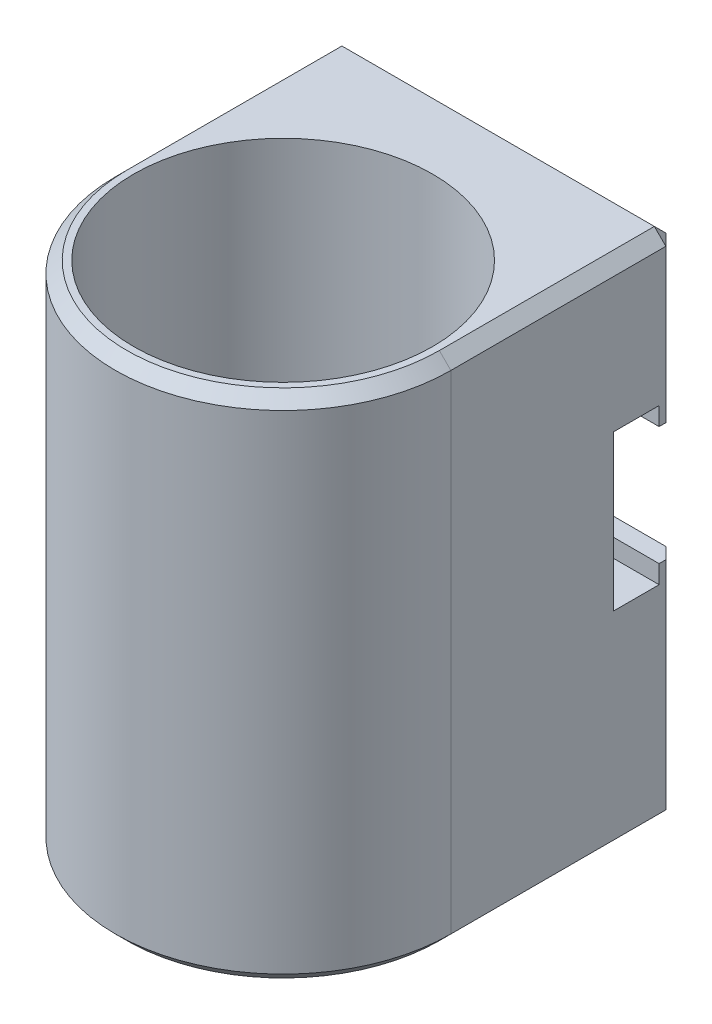
ISO-10303-21;
HEADER;
FILE_DESCRIPTION(('STEP AP214'),'2;1');
FILE_NAME('part.step','',(''),(''),'','','');
FILE_SCHEMA(('AUTOMOTIVE_DESIGN { 1 0 10303 214 1 1 1 1 }'));
ENDSEC;
DATA;
#1=APPLICATION_CONTEXT('core data for automotive mechanical design processes');
#2=APPLICATION_PROTOCOL_DEFINITION('international standard','automotive_design',2000,#1);
#3=PRODUCT_CONTEXT('',#1,'mechanical');
#4=PRODUCT('Part','Part','',(#3));
#5=PRODUCT_RELATED_PRODUCT_CATEGORY('part','',(#4));
#6=PRODUCT_DEFINITION_FORMATION('','',#4);
#7=PRODUCT_DEFINITION_CONTEXT('part definition',#1,'design');
#8=PRODUCT_DEFINITION('design','',#6,#7);
#9=PRODUCT_DEFINITION_SHAPE('','',#8);
#10=(LENGTH_UNIT() NAMED_UNIT(*) SI_UNIT(.MILLI.,.METRE.));
#11=(NAMED_UNIT(*) PLANE_ANGLE_UNIT() SI_UNIT($,.RADIAN.));
#12=(NAMED_UNIT(*) SI_UNIT($,.STERADIAN.) SOLID_ANGLE_UNIT());
#13=UNCERTAINTY_MEASURE_WITH_UNIT(LENGTH_MEASURE(1.E-05),#10,'distance_accuracy_value','');
#14=(GEOMETRIC_REPRESENTATION_CONTEXT(3) GLOBAL_UNCERTAINTY_ASSIGNED_CONTEXT((#13)) GLOBAL_UNIT_ASSIGNED_CONTEXT((#10,
#11,#12)) REPRESENTATION_CONTEXT('',''));
#15=CARTESIAN_POINT('',(0.,0.,0.));
#16=DIRECTION('',(0.,0.,1.));
#17=DIRECTION('',(1.,0.,0.));
#18=AXIS2_PLACEMENT_3D('',#15,#16,#17);
#19=CARTESIAN_POINT('',(-14.5875,44.45,-19.7));
#20=DIRECTION('',(0.,0.,1.));
#21=DIRECTION('',(1.,0.,0.));
#22=AXIS2_PLACEMENT_3D('',#19,#20,#21);
#23=PLANE('',#22);
#24=DIRECTION('',(-1.,0.,0.));
#25=VECTOR('',#24,1.);
#26=CARTESIAN_POINT('',(-14.5875,1.,-19.7));
#27=LINE('',#26,#25);
#28=CARTESIAN_POINT('',(13.5875,1.,-19.7));
#29=VERTEX_POINT('',#28);
#30=CARTESIAN_POINT('',(-13.5875,1.,-19.7));
#31=VERTEX_POINT('',#30);
#32=EDGE_CURVE('E265',#29,#31,#27,.T.);
#33=ORIENTED_EDGE('',*,*,#32,.T.);
#34=DIRECTION('',(0.,1.,0.));
#35=VECTOR('',#34,1.);
#36=CARTESIAN_POINT('',(-13.5875,44.45,-19.7));
#37=LINE('',#36,#35);
#38=CARTESIAN_POINT('',(-13.5875,19.84375,-19.7));
#39=VERTEX_POINT('',#38);
#40=EDGE_CURVE('E269',#31,#39,#37,.T.);
#41=ORIENTED_EDGE('',*,*,#40,.T.);
#42=DIRECTION('',(1.,0.,0.));
#43=VECTOR('',#42,1.);
#44=CARTESIAN_POINT('',(-14.5875,19.84375,-19.7));
#45=LINE('',#44,#43);
#46=CARTESIAN_POINT('',(13.5875,19.84375,-19.7));
#47=VERTEX_POINT('',#46);
#48=EDGE_CURVE('E231',#39,#47,#45,.T.);
#49=ORIENTED_EDGE('',*,*,#48,.T.);
#50=DIRECTION('',(0.,-1.,0.));
#51=VECTOR('',#50,1.);
#52=CARTESIAN_POINT('',(13.5875,44.45,-19.7));
#53=LINE('',#52,#51);
#54=EDGE_CURVE('E267',#47,#29,#53,.T.);
#55=ORIENTED_EDGE('',*,*,#54,.T.);
#56=EDGE_LOOP('',(#33,#41,#49,#55));
#57=FACE_BOUND('',#56,.T.);
#58=ADVANCED_FACE('F33',(#57),#23,.F.);
#59=CARTESIAN_POINT('',(0.,44.45,0.));
#60=DIRECTION('',(0.,1.,0.));
#61=DIRECTION('',(0.,0.,1.));
#62=AXIS2_PLACEMENT_3D('',#59,#60,#61);
#63=PLANE('',#62);
#64=DIRECTION('',(0.,0.,-1.));
#65=VECTOR('',#64,1.);
#66=CARTESIAN_POINT('',(13.5875,44.45,-19.7));
#67=LINE('',#66,#65);
#68=CARTESIAN_POINT('',(13.5875,44.45,0.));
#69=VERTEX_POINT('',#68);
#70=CARTESIAN_POINT('',(13.5875,44.45,-18.7));
#71=VERTEX_POINT('',#70);
#72=EDGE_CURVE('E57',#69,#71,#67,.T.);
#73=ORIENTED_EDGE('',*,*,#72,.T.);
#74=DIRECTION('',(-1.,0.,0.));
#75=VECTOR('',#74,1.);
#76=CARTESIAN_POINT('',(-14.5875,44.45,-18.7));
#77=LINE('',#76,#75);
#78=CARTESIAN_POINT('',(-13.5875,44.45,-18.7));
#79=VERTEX_POINT('',#78);
#80=EDGE_CURVE('E11',#71,#79,#77,.T.);
#81=ORIENTED_EDGE('',*,*,#80,.T.);
#82=DIRECTION('',(0.,0.,1.));
#83=VECTOR('',#82,1.);
#84=CARTESIAN_POINT('',(-13.5875,44.45,0.));
#85=LINE('',#84,#83);
#86=CARTESIAN_POINT('',(-13.5875,44.45,0.));
#87=VERTEX_POINT('',#86);
#88=EDGE_CURVE('E42',#79,#87,#85,.T.);
#89=ORIENTED_EDGE('',*,*,#88,.T.);
#90=CARTESIAN_POINT('',(0.,44.45,0.));
#91=DIRECTION('',(0.,1.,0.));
#92=DIRECTION('',(0.,0.,1.));
#93=AXIS2_PLACEMENT_3D('',#90,#91,#92);
#94=CIRCLE('',#93,13.5875);
#95=EDGE_CURVE('E307',#87,#69,#94,.T.);
#96=ORIENTED_EDGE('',*,*,#95,.T.);
#97=EDGE_LOOP('',(#73,#81,#89,#96));
#98=FACE_BOUND('',#97,.T.);
#99=CARTESIAN_POINT('',(0.,44.45,0.));
#100=DIRECTION('',(0.,1.,0.));
#101=DIRECTION('',(0.,0.,1.));
#102=AXIS2_PLACEMENT_3D('',#99,#100,#101);
#103=CIRCLE('',#102,13.);
#104=CARTESIAN_POINT('',(0.,44.45,13.));
#105=VERTEX_POINT('',#104);
#106=EDGE_CURVE('E245',#105,#105,#103,.T.);
#107=ORIENTED_EDGE('',*,*,#106,.F.);
#108=EDGE_LOOP('',(#107));
#109=FACE_BOUND('',#108,.T.);
#110=ADVANCED_FACE('F442',(#98,#109),#63,.T.);
#111=CARTESIAN_POINT('',(0.,0.,0.));
#112=DIRECTION('',(0.,1.,0.));
#113=DIRECTION('',(0.,0.,1.));
#114=AXIS2_PLACEMENT_3D('',#111,#112,#113);
#115=PLANE('',#114);
#116=DIRECTION('',(0.,0.,-1.));
#117=VECTOR('',#116,1.);
#118=CARTESIAN_POINT('',(-13.5875,0.,0.));
#119=LINE('',#118,#117);
#120=CARTESIAN_POINT('',(-13.5875,0.,0.));
#121=VERTEX_POINT('',#120);
#122=CARTESIAN_POINT('',(-13.5875,0.,-18.7));
#123=VERTEX_POINT('',#122);
#124=EDGE_CURVE('E287',#121,#123,#119,.T.);
#125=ORIENTED_EDGE('',*,*,#124,.T.);
#126=DIRECTION('',(1.,0.,0.));
#127=VECTOR('',#126,1.);
#128=CARTESIAN_POINT('',(0.,0.,-18.7));
#129=LINE('',#128,#127);
#130=CARTESIAN_POINT('',(13.5875,0.,-18.7));
#131=VERTEX_POINT('',#130);
#132=EDGE_CURVE('E289',#123,#131,#129,.T.);
#133=ORIENTED_EDGE('',*,*,#132,.T.);
#134=DIRECTION('',(0.,0.,1.));
#135=VECTOR('',#134,1.);
#136=CARTESIAN_POINT('',(13.5875,0.,0.));
#137=LINE('',#136,#135);
#138=CARTESIAN_POINT('',(13.5875,0.,0.));
#139=VERTEX_POINT('',#138);
#140=EDGE_CURVE('E283',#131,#139,#137,.T.);
#141=ORIENTED_EDGE('',*,*,#140,.T.);
#142=CARTESIAN_POINT('',(0.,0.,0.));
#143=DIRECTION('',(0.,1.,0.));
#144=DIRECTION('',(0.,0.,1.));
#145=AXIS2_PLACEMENT_3D('',#142,#143,#144);
#146=CIRCLE('',#145,13.5875);
#147=EDGE_CURVE('E285',#139,#121,#146,.F.);
#148=ORIENTED_EDGE('',*,*,#147,.T.);
#149=EDGE_LOOP('',(#125,#133,#141,#148));
#150=FACE_BOUND('',#149,.T.);
#151=CARTESIAN_POINT('',(0.,0.,0.));
#152=DIRECTION('',(0.,1.,0.));
#153=DIRECTION('',(0.,0.,1.));
#154=AXIS2_PLACEMENT_3D('',#151,#152,#153);
#155=CIRCLE('',#154,13.);
#156=CARTESIAN_POINT('',(0.,0.,13.));
#157=VERTEX_POINT('',#156);
#158=EDGE_CURVE('E234',#157,#157,#155,.T.);
#159=ORIENTED_EDGE('',*,*,#158,.T.);
#160=EDGE_LOOP('',(#159));
#161=FACE_BOUND('',#160,.T.);
#162=ADVANCED_FACE('F439',(#150,#161),#115,.F.);
#163=CARTESIAN_POINT('',(0.,44.45,0.));
#164=DIRECTION('',(0.,-1.,0.));
#165=DIRECTION('',(0.,0.,-1.));
#166=AXIS2_PLACEMENT_3D('',#163,#164,#165);
#167=CYLINDRICAL_SURFACE('',#166,14.5875);
#168=DIRECTION('',(0.,-1.,0.));
#169=VECTOR('',#168,1.);
#170=CARTESIAN_POINT('',(-14.5875,44.45,0.));
#171=LINE('',#170,#169);
#172=CARTESIAN_POINT('',(-14.5875,43.45,0.));
#173=VERTEX_POINT('',#172);
#174=CARTESIAN_POINT('',(-14.5875,1.,0.));
#175=VERTEX_POINT('',#174);
#176=EDGE_CURVE('E248',#173,#175,#171,.T.);
#177=ORIENTED_EDGE('',*,*,#176,.T.);
#178=CARTESIAN_POINT('',(0.,1.,0.));
#179=DIRECTION('',(0.,1.,0.));
#180=DIRECTION('',(0.,0.,1.));
#181=AXIS2_PLACEMENT_3D('',#178,#179,#180);
#182=CIRCLE('',#181,14.5875);
#183=CARTESIAN_POINT('',(14.5875,1.,0.));
#184=VERTEX_POINT('',#183);
#185=EDGE_CURVE('E294',#175,#184,#182,.T.);
#186=ORIENTED_EDGE('',*,*,#185,.T.);
#187=DIRECTION('',(0.,-1.,0.));
#188=VECTOR('',#187,1.);
#189=CARTESIAN_POINT('',(14.5875,44.45,0.));
#190=LINE('',#189,#188);
#191=CARTESIAN_POINT('',(14.5875,43.45,0.));
#192=VERTEX_POINT('',#191);
#193=EDGE_CURVE('E253',#192,#184,#190,.T.);
#194=ORIENTED_EDGE('',*,*,#193,.F.);
#195=CARTESIAN_POINT('',(0.,43.45,0.));
#196=DIRECTION('',(0.,1.,0.));
#197=DIRECTION('',(0.,0.,1.));
#198=AXIS2_PLACEMENT_3D('',#195,#196,#197);
#199=CIRCLE('',#198,14.5875);
#200=EDGE_CURVE('E292',#192,#173,#199,.F.);
#201=ORIENTED_EDGE('',*,*,#200,.T.);
#202=EDGE_LOOP('',(#177,#186,#194,#201));
#203=FACE_BOUND('',#202,.T.);
#204=ADVANCED_FACE('F415',(#203),#167,.T.);
#205=CARTESIAN_POINT('',(14.5875,44.45,-19.7));
#206=DIRECTION('',(-1.,0.,0.));
#207=DIRECTION('',(0.,0.,1.));
#208=AXIS2_PLACEMENT_3D('',#205,#206,#207);
#209=PLANE('',#208);
#210=DIRECTION('',(0.,0.,-1.));
#211=VECTOR('',#210,1.);
#212=CARTESIAN_POINT('',(14.5875,1.,-19.7));
#213=LINE('',#212,#211);
#214=CARTESIAN_POINT('',(14.5875,1.,-18.7));
#215=VERTEX_POINT('',#214);
#216=EDGE_CURVE('E279',#184,#215,#213,.T.);
#217=ORIENTED_EDGE('',*,*,#216,.T.);
#218=DIRECTION('',(0.,1.,0.));
#219=VECTOR('',#218,1.);
#220=CARTESIAN_POINT('',(14.5875,44.45,-18.7));
#221=LINE('',#220,#219);
#222=CARTESIAN_POINT('',(14.5875,19.84375,-18.7));
#223=VERTEX_POINT('',#222);
#224=EDGE_CURVE('E281',#215,#223,#221,.T.);
#225=ORIENTED_EDGE('',*,*,#224,.T.);
#226=DIRECTION('',(0.,0.,-1.));
#227=VECTOR('',#226,1.);
#228=CARTESIAN_POINT('',(14.5875,19.84375,-18.1125));
#229=LINE('',#228,#227);
#230=CARTESIAN_POINT('',(14.5875,19.84375,-18.1125));
#231=VERTEX_POINT('',#230);
#232=EDGE_CURVE('E201',#231,#223,#229,.T.);
#233=ORIENTED_EDGE('',*,*,#232,.F.);
#234=DIRECTION('',(0.,1.,0.));
#235=VECTOR('',#234,1.);
#236=CARTESIAN_POINT('',(14.5875,18.25625,-18.1125));
#237=LINE('',#236,#235);
#238=CARTESIAN_POINT('',(14.5875,18.25625,-18.1125));
#239=VERTEX_POINT('',#238);
#240=EDGE_CURVE('E226',#239,#231,#237,.T.);
#241=ORIENTED_EDGE('',*,*,#240,.F.);
#242=DIRECTION('',(0.,0.,-1.));
#243=VECTOR('',#242,1.);
#244=CARTESIAN_POINT('',(14.5875,18.25625,-14.14375));
#245=LINE('',#244,#243);
#246=CARTESIAN_POINT('',(14.5875,18.25625,-14.14375));
#247=VERTEX_POINT('',#246);
#248=EDGE_CURVE('E223',#247,#239,#245,.T.);
#249=ORIENTED_EDGE('',*,*,#248,.F.);
#250=DIRECTION('',(0.,-1.,0.));
#251=VECTOR('',#250,1.);
#252=CARTESIAN_POINT('',(14.5875,31.75,-14.14375));
#253=LINE('',#252,#251);
#254=CARTESIAN_POINT('',(14.5875,31.75,-14.14375));
#255=VERTEX_POINT('',#254);
#256=EDGE_CURVE('E220',#255,#247,#253,.T.);
#257=ORIENTED_EDGE('',*,*,#256,.F.);
#258=DIRECTION('',(0.,0.,1.));
#259=VECTOR('',#258,1.);
#260=CARTESIAN_POINT('',(14.5875,31.75,-18.1125));
#261=LINE('',#260,#259);
#262=CARTESIAN_POINT('',(14.5875,31.75,-18.1125));
#263=VERTEX_POINT('',#262);
#264=EDGE_CURVE('E218',#263,#255,#261,.T.);
#265=ORIENTED_EDGE('',*,*,#264,.F.);
#266=DIRECTION('',(0.,1.,0.));
#267=VECTOR('',#266,1.);
#268=CARTESIAN_POINT('',(14.5875,30.1625,-18.1125));
#269=LINE('',#268,#267);
#270=CARTESIAN_POINT('',(14.5875,30.1625,-18.1125));
#271=VERTEX_POINT('',#270);
#272=EDGE_CURVE('E181',#271,#263,#269,.T.);
#273=ORIENTED_EDGE('',*,*,#272,.F.);
#274=DIRECTION('',(0.,0.,1.));
#275=VECTOR('',#274,1.);
#276=CARTESIAN_POINT('',(14.5875,30.1625,-19.7));
#277=LINE('',#276,#275);
#278=CARTESIAN_POINT('',(14.5875,30.1625,-18.7));
#279=VERTEX_POINT('',#278);
#280=EDGE_CURVE('E214',#279,#271,#277,.T.);
#281=ORIENTED_EDGE('',*,*,#280,.F.);
#282=DIRECTION('',(0.,1.,0.));
#283=VECTOR('',#282,1.);
#284=CARTESIAN_POINT('',(14.5875,44.45,-18.7));
#285=LINE('',#284,#283);
#286=CARTESIAN_POINT('',(14.5875,43.45,-18.7));
#287=VERTEX_POINT('',#286);
#288=EDGE_CURVE('E277',#279,#287,#285,.T.);
#289=ORIENTED_EDGE('',*,*,#288,.T.);
#290=DIRECTION('',(0.,0.,1.));
#291=VECTOR('',#290,1.);
#292=CARTESIAN_POINT('',(14.5875,43.45,0.));
#293=LINE('',#292,#291);
#294=EDGE_CURVE('E275',#287,#192,#293,.T.);
#295=ORIENTED_EDGE('',*,*,#294,.T.);
#296=ORIENTED_EDGE('',*,*,#193,.T.);
#297=EDGE_LOOP('',(#217,#225,#233,#241,#249,#257,#265,#273,#281,#289,#295,#296));
#298=FACE_BOUND('',#297,.T.);
#299=ADVANCED_FACE('F380',(#298),#209,.F.);
#300=DIRECTION('',(1.,0.,0.));
#301=VECTOR('',#300,1.);
#302=CARTESIAN_POINT('',(14.5875,43.45,-19.7));
#303=LINE('',#302,#301);
#304=CARTESIAN_POINT('',(-13.5875,43.45,-19.7));
#305=VERTEX_POINT('',#304);
#306=CARTESIAN_POINT('',(13.5875,43.45,-19.7));
#307=VERTEX_POINT('',#306);
#308=EDGE_CURVE('E296',#305,#307,#303,.T.);
#309=ORIENTED_EDGE('',*,*,#308,.T.);
#310=DIRECTION('',(0.,-1.,0.));
#311=VECTOR('',#310,1.);
#312=CARTESIAN_POINT('',(13.5875,44.45,-19.7));
#313=LINE('',#312,#311);
#314=CARTESIAN_POINT('',(13.5875,30.1625,-19.7));
#315=VERTEX_POINT('',#314);
#316=EDGE_CURVE('E300',#307,#315,#313,.T.);
#317=ORIENTED_EDGE('',*,*,#316,.T.);
#318=DIRECTION('',(1.,0.,0.));
#319=VECTOR('',#318,1.);
#320=CARTESIAN_POINT('',(-14.5875,30.1625,-19.7));
#321=LINE('',#320,#319);
#322=CARTESIAN_POINT('',(-13.5875,30.1625,-19.7));
#323=VERTEX_POINT('',#322);
#324=EDGE_CURVE('E213',#323,#315,#321,.T.);
#325=ORIENTED_EDGE('',*,*,#324,.F.);
#326=DIRECTION('',(0.,1.,0.));
#327=VECTOR('',#326,1.);
#328=CARTESIAN_POINT('',(-13.5875,44.45,-19.7));
#329=LINE('',#328,#327);
#330=EDGE_CURVE('E298',#323,#305,#329,.T.);
#331=ORIENTED_EDGE('',*,*,#330,.T.);
#332=EDGE_LOOP('',(#309,#317,#325,#331));
#333=FACE_BOUND('',#332,.T.);
#334=ADVANCED_FACE('F371',(#333),#23,.F.);
#335=CARTESIAN_POINT('',(-14.5875,44.45,0.));
#336=DIRECTION('',(1.,0.,0.));
#337=DIRECTION('',(0.,0.,-1.));
#338=AXIS2_PLACEMENT_3D('',#335,#336,#337);
#339=PLANE('',#338);
#340=DIRECTION('',(0.,0.,-1.));
#341=VECTOR('',#340,1.);
#342=CARTESIAN_POINT('',(-14.5875,19.84375,-18.1125));
#343=LINE('',#342,#341);
#344=CARTESIAN_POINT('',(-14.5875,19.84375,-18.1125));
#345=VERTEX_POINT('',#344);
#346=CARTESIAN_POINT('',(-14.5875,19.84375,-18.7));
#347=VERTEX_POINT('',#346);
#348=EDGE_CURVE('E211',#345,#347,#343,.T.);
#349=ORIENTED_EDGE('',*,*,#348,.T.);
#350=DIRECTION('',(0.,-1.,0.));
#351=VECTOR('',#350,1.);
#352=CARTESIAN_POINT('',(-14.5875,44.45,-18.7));
#353=LINE('',#352,#351);
#354=CARTESIAN_POINT('',(-14.5875,1.,-18.7));
#355=VERTEX_POINT('',#354);
#356=EDGE_CURVE('E262',#347,#355,#353,.T.);
#357=ORIENTED_EDGE('',*,*,#356,.T.);
#358=DIRECTION('',(0.,0.,1.));
#359=VECTOR('',#358,1.);
#360=CARTESIAN_POINT('',(-14.5875,1.,0.));
#361=LINE('',#360,#359);
#362=EDGE_CURVE('E260',#355,#175,#361,.T.);
#363=ORIENTED_EDGE('',*,*,#362,.T.);
#364=ORIENTED_EDGE('',*,*,#176,.F.);
#365=DIRECTION('',(0.,0.,-1.));
#366=VECTOR('',#365,1.);
#367=CARTESIAN_POINT('',(-14.5875,43.45,-19.7));
#368=LINE('',#367,#366);
#369=CARTESIAN_POINT('',(-14.5875,43.45,-18.7));
#370=VERTEX_POINT('',#369);
#371=EDGE_CURVE('E256',#173,#370,#368,.T.);
#372=ORIENTED_EDGE('',*,*,#371,.T.);
#373=DIRECTION('',(0.,-1.,0.));
#374=VECTOR('',#373,1.);
#375=CARTESIAN_POINT('',(-14.5875,44.45,-18.7));
#376=LINE('',#375,#374);
#377=CARTESIAN_POINT('',(-14.5875,30.1625,-18.7));
#378=VERTEX_POINT('',#377);
#379=EDGE_CURVE('E258',#370,#378,#376,.T.);
#380=ORIENTED_EDGE('',*,*,#379,.T.);
#381=DIRECTION('',(0.,0.,1.));
#382=VECTOR('',#381,1.);
#383=CARTESIAN_POINT('',(-14.5875,30.1625,-19.7));
#384=LINE('',#383,#382);
#385=CARTESIAN_POINT('',(-14.5875,30.1625,-18.1125));
#386=VERTEX_POINT('',#385);
#387=EDGE_CURVE('E199',#378,#386,#384,.T.);
#388=ORIENTED_EDGE('',*,*,#387,.T.);
#389=DIRECTION('',(0.,1.,0.));
#390=VECTOR('',#389,1.);
#391=CARTESIAN_POINT('',(-14.5875,30.1625,-18.1125));
#392=LINE('',#391,#390);
#393=CARTESIAN_POINT('',(-14.5875,31.75,-18.1125));
#394=VERTEX_POINT('',#393);
#395=EDGE_CURVE('E178',#386,#394,#392,.T.);
#396=ORIENTED_EDGE('',*,*,#395,.T.);
#397=DIRECTION('',(0.,0.,1.));
#398=VECTOR('',#397,1.);
#399=CARTESIAN_POINT('',(-14.5875,31.75,-18.1125));
#400=LINE('',#399,#398);
#401=CARTESIAN_POINT('',(-14.5875,31.75,-14.14375));
#402=VERTEX_POINT('',#401);
#403=EDGE_CURVE('E189',#394,#402,#400,.T.);
#404=ORIENTED_EDGE('',*,*,#403,.T.);
#405=DIRECTION('',(0.,-1.,0.));
#406=VECTOR('',#405,1.);
#407=CARTESIAN_POINT('',(-14.5875,31.75,-14.14375));
#408=LINE('',#407,#406);
#409=CARTESIAN_POINT('',(-14.5875,18.25625,-14.14375));
#410=VERTEX_POINT('',#409);
#411=EDGE_CURVE('E194',#402,#410,#408,.T.);
#412=ORIENTED_EDGE('',*,*,#411,.T.);
#413=DIRECTION('',(0.,0.,-1.));
#414=VECTOR('',#413,1.);
#415=CARTESIAN_POINT('',(-14.5875,18.25625,-14.14375));
#416=LINE('',#415,#414);
#417=CARTESIAN_POINT('',(-14.5875,18.25625,-18.1125));
#418=VERTEX_POINT('',#417);
#419=EDGE_CURVE('E205',#410,#418,#416,.T.);
#420=ORIENTED_EDGE('',*,*,#419,.T.);
#421=DIRECTION('',(0.,1.,0.));
#422=VECTOR('',#421,1.);
#423=CARTESIAN_POINT('',(-14.5875,18.25625,-18.1125));
#424=LINE('',#423,#422);
#425=EDGE_CURVE('E208',#418,#345,#424,.T.);
#426=ORIENTED_EDGE('',*,*,#425,.T.);
#427=EDGE_LOOP('',(#349,#357,#363,#364,#372,#380,#388,#396,#404,#412,#420,#426));
#428=FACE_BOUND('',#427,.T.);
#429=ADVANCED_FACE('F197',(#428),#339,.F.);
#430=CARTESIAN_POINT('',(0.,44.45,0.));
#431=DIRECTION('',(0.,-1.,0.));
#432=DIRECTION('',(0.,0.,-1.));
#433=AXIS2_PLACEMENT_3D('',#430,#431,#432);
#434=CYLINDRICAL_SURFACE('',#433,13.);
#435=ORIENTED_EDGE('',*,*,#106,.T.);
#436=EDGE_LOOP('',(#435));
#437=FACE_BOUND('',#436,.T.);
#438=ORIENTED_EDGE('',*,*,#158,.F.);
#439=EDGE_LOOP('',(#438));
#440=FACE_BOUND('',#439,.T.);
#441=ADVANCED_FACE('F446',(#437,#440),#434,.F.);
#442=CARTESIAN_POINT('',(-14.5875,19.84375,-18.1125));
#443=DIRECTION('',(0.,-1.,0.));
#444=DIRECTION('',(0.,0.,-1.));
#445=AXIS2_PLACEMENT_3D('',#442,#443,#444);
#446=PLANE('',#445);
#447=ORIENTED_EDGE('',*,*,#48,.F.);
#448=DIRECTION('',(0.70710678118655,0.,-0.707106781186545));
#449=VECTOR('',#448,1.);
#450=CARTESIAN_POINT('',(-14.5875,19.84375,-18.7));
#451=LINE('',#450,#449);
#452=EDGE_CURVE('E273',#39,#347,#451,.F.);
#453=ORIENTED_EDGE('',*,*,#452,.T.);
#454=ORIENTED_EDGE('',*,*,#348,.F.);
#455=DIRECTION('',(1.,0.,0.));
#456=VECTOR('',#455,1.);
#457=CARTESIAN_POINT('',(-14.5875,19.84375,-18.1125));
#458=LINE('',#457,#456);
#459=EDGE_CURVE('E235',#345,#231,#458,.T.);
#460=ORIENTED_EDGE('',*,*,#459,.T.);
#461=ORIENTED_EDGE('',*,*,#232,.T.);
#462=DIRECTION('',(0.70710678118655,0.,0.707106781186545));
#463=VECTOR('',#462,1.);
#464=CARTESIAN_POINT('',(13.5875,19.84375,-19.7));
#465=LINE('',#464,#463);
#466=EDGE_CURVE('E271',#223,#47,#465,.F.);
#467=ORIENTED_EDGE('',*,*,#466,.T.);
#468=EDGE_LOOP('',(#447,#453,#454,#460,#461,#467));
#469=FACE_BOUND('',#468,.T.);
#470=ADVANCED_FACE('F397',(#469),#446,.F.);
#471=CARTESIAN_POINT('',(-14.5875,18.25625,-18.1125));
#472=DIRECTION('',(0.,0.,-1.));
#473=DIRECTION('',(-1.,0.,0.));
#474=AXIS2_PLACEMENT_3D('',#471,#472,#473);
#475=PLANE('',#474);
#476=ORIENTED_EDGE('',*,*,#240,.T.);
#477=ORIENTED_EDGE('',*,*,#459,.F.);
#478=ORIENTED_EDGE('',*,*,#425,.F.);
#479=DIRECTION('',(1.,0.,0.));
#480=VECTOR('',#479,1.);
#481=CARTESIAN_POINT('',(-14.5875,18.25625,-18.1125));
#482=LINE('',#481,#480);
#483=EDGE_CURVE('E237',#418,#239,#482,.T.);
#484=ORIENTED_EDGE('',*,*,#483,.T.);
#485=EDGE_LOOP('',(#476,#477,#478,#484));
#486=FACE_BOUND('',#485,.T.);
#487=ADVANCED_FACE('F392',(#486),#475,.F.);
#488=CARTESIAN_POINT('',(-14.5875,18.25625,-14.14375));
#489=DIRECTION('',(0.,-1.,0.));
#490=DIRECTION('',(0.,0.,-1.));
#491=AXIS2_PLACEMENT_3D('',#488,#489,#490);
#492=PLANE('',#491);
#493=ORIENTED_EDGE('',*,*,#248,.T.);
#494=ORIENTED_EDGE('',*,*,#483,.F.);
#495=ORIENTED_EDGE('',*,*,#419,.F.);
#496=DIRECTION('',(1.,0.,0.));
#497=VECTOR('',#496,1.);
#498=CARTESIAN_POINT('',(-14.5875,18.25625,-14.14375));
#499=LINE('',#498,#497);
#500=EDGE_CURVE('E239',#410,#247,#499,.T.);
#501=ORIENTED_EDGE('',*,*,#500,.T.);
#502=EDGE_LOOP('',(#493,#494,#495,#501));
#503=FACE_BOUND('',#502,.T.);
#504=ADVANCED_FACE('F390',(#503),#492,.F.);
#505=CARTESIAN_POINT('',(-14.5875,31.75,-14.14375));
#506=DIRECTION('',(0.,0.,1.));
#507=DIRECTION('',(0.,-1.,0.));
#508=AXIS2_PLACEMENT_3D('',#505,#506,#507);
#509=PLANE('',#508);
#510=ORIENTED_EDGE('',*,*,#256,.T.);
#511=ORIENTED_EDGE('',*,*,#500,.F.);
#512=ORIENTED_EDGE('',*,*,#411,.F.);
#513=DIRECTION('',(1.,0.,0.));
#514=VECTOR('',#513,1.);
#515=CARTESIAN_POINT('',(-14.5875,31.75,-14.14375));
#516=LINE('',#515,#514);
#517=EDGE_CURVE('E185',#402,#255,#516,.T.);
#518=ORIENTED_EDGE('',*,*,#517,.T.);
#519=EDGE_LOOP('',(#510,#511,#512,#518));
#520=FACE_BOUND('',#519,.T.);
#521=ADVANCED_FACE('F386',(#520),#509,.F.);
#522=CARTESIAN_POINT('',(-14.5875,31.75,-18.1125));
#523=DIRECTION('',(0.,1.,0.));
#524=DIRECTION('',(0.,0.,1.));
#525=AXIS2_PLACEMENT_3D('',#522,#523,#524);
#526=PLANE('',#525);
#527=ORIENTED_EDGE('',*,*,#264,.T.);
#528=ORIENTED_EDGE('',*,*,#517,.F.);
#529=ORIENTED_EDGE('',*,*,#403,.F.);
#530=DIRECTION('',(1.,0.,0.));
#531=VECTOR('',#530,1.);
#532=CARTESIAN_POINT('',(-14.5875,31.75,-18.1125));
#533=LINE('',#532,#531);
#534=EDGE_CURVE('E173',#394,#263,#533,.T.);
#535=ORIENTED_EDGE('',*,*,#534,.T.);
#536=EDGE_LOOP('',(#527,#528,#529,#535));
#537=FACE_BOUND('',#536,.T.);
#538=ADVANCED_FACE('F190',(#537),#526,.F.);
#539=CARTESIAN_POINT('',(-14.5875,30.1625,-18.1125));
#540=DIRECTION('',(0.,0.,-1.));
#541=DIRECTION('',(-1.,0.,0.));
#542=AXIS2_PLACEMENT_3D('',#539,#540,#541);
#543=PLANE('',#542);
#544=ORIENTED_EDGE('',*,*,#272,.T.);
#545=ORIENTED_EDGE('',*,*,#534,.F.);
#546=ORIENTED_EDGE('',*,*,#395,.F.);
#547=DIRECTION('',(1.,0.,0.));
#548=VECTOR('',#547,1.);
#549=CARTESIAN_POINT('',(-14.5875,30.1625,-18.1125));
#550=LINE('',#549,#548);
#551=EDGE_CURVE('E186',#386,#271,#550,.T.);
#552=ORIENTED_EDGE('',*,*,#551,.T.);
#553=EDGE_LOOP('',(#544,#545,#546,#552));
#554=FACE_BOUND('',#553,.T.);
#555=ADVANCED_FACE('F175',(#554),#543,.F.);
#556=CARTESIAN_POINT('',(-14.5875,30.1625,-19.7));
#557=DIRECTION('',(0.,1.,0.));
#558=DIRECTION('',(0.,0.,1.));
#559=AXIS2_PLACEMENT_3D('',#556,#557,#558);
#560=PLANE('',#559);
#561=ORIENTED_EDGE('',*,*,#324,.T.);
#562=DIRECTION('',(-0.707106781186544,0.,-0.707106781186551));
#563=VECTOR('',#562,1.);
#564=CARTESIAN_POINT('',(13.5875,30.1625,-19.7));
#565=LINE('',#564,#563);
#566=EDGE_CURVE('E305',#315,#279,#565,.F.);
#567=ORIENTED_EDGE('',*,*,#566,.T.);
#568=ORIENTED_EDGE('',*,*,#280,.T.);
#569=ORIENTED_EDGE('',*,*,#551,.F.);
#570=ORIENTED_EDGE('',*,*,#387,.F.);
#571=DIRECTION('',(-0.707106781186551,0.,0.707106781186544));
#572=VECTOR('',#571,1.);
#573=CARTESIAN_POINT('',(-14.5875,30.1625,-18.7));
#574=LINE('',#573,#572);
#575=EDGE_CURVE('E303',#378,#323,#574,.F.);
#576=ORIENTED_EDGE('',*,*,#575,.T.);
#577=EDGE_LOOP('',(#561,#567,#568,#569,#570,#576));
#578=FACE_BOUND('',#577,.T.);
#579=ADVANCED_FACE('F369',(#578),#560,.F.);
#580=CARTESIAN_POINT('',(14.5875,1.,-19.7));
#581=DIRECTION('',(-0.707106781186545,0.70710678118655,0.));
#582=DIRECTION('',(0.,0.,-1.));
#583=AXIS2_PLACEMENT_3D('',#580,#581,#582);
#584=PLANE('',#583);
#585=DIRECTION('',(0.70710678118655,0.707106781186545,0.));
#586=VECTOR('',#585,1.);
#587=CARTESIAN_POINT('',(14.0875,0.5,-18.7));
#588=LINE('',#587,#586);
#589=EDGE_CURVE('E327',#215,#131,#588,.F.);
#590=ORIENTED_EDGE('',*,*,#589,.F.);
#591=ORIENTED_EDGE('',*,*,#216,.F.);
#592=DIRECTION('',(0.70710678118655,0.707106781186545,0.));
#593=VECTOR('',#592,1.);
#594=CARTESIAN_POINT('',(13.5875,0.,0.));
#595=LINE('',#594,#593);
#596=EDGE_CURVE('E216',#139,#184,#595,.T.);
#597=ORIENTED_EDGE('',*,*,#596,.F.);
#598=ORIENTED_EDGE('',*,*,#140,.F.);
#599=EDGE_LOOP('',(#590,#591,#597,#598));
#600=FACE_BOUND('',#599,.T.);
#601=ADVANCED_FACE('F425',(#600),#584,.F.);
#602=CARTESIAN_POINT('',(13.5875,44.45,-19.7));
#603=DIRECTION('',(-0.707106781186545,0.,0.70710678118655));
#604=DIRECTION('',(0.,-1.,0.));
#605=AXIS2_PLACEMENT_3D('',#602,#603,#604);
#606=PLANE('',#605);
#607=ORIENTED_EDGE('',*,*,#466,.F.);
#608=ORIENTED_EDGE('',*,*,#224,.F.);
#609=DIRECTION('',(-0.70710678118655,0.,-0.707106781186545));
#610=VECTOR('',#609,1.);
#611=CARTESIAN_POINT('',(13.5875,1.,-19.7));
#612=LINE('',#611,#610);
#613=EDGE_CURVE('E324',#29,#215,#612,.F.);
#614=ORIENTED_EDGE('',*,*,#613,.F.);
#615=ORIENTED_EDGE('',*,*,#54,.F.);
#616=EDGE_LOOP('',(#607,#608,#614,#615));
#617=FACE_BOUND('',#616,.T.);
#618=ADVANCED_FACE('F430',(#617),#606,.F.);
#619=CARTESIAN_POINT('',(0.,1.,0.));
#620=DIRECTION('',(0.,1.,0.));
#621=DIRECTION('',(0.,0.,1.));
#622=AXIS2_PLACEMENT_3D('',#619,#620,#621);
#623=CONICAL_SURFACE('',#622,14.5875,0.785398163397452);
#624=ORIENTED_EDGE('',*,*,#596,.T.);
#625=ORIENTED_EDGE('',*,*,#185,.F.);
#626=DIRECTION('',(-0.70710678118655,0.707106781186545,0.));
#627=VECTOR('',#626,1.);
#628=CARTESIAN_POINT('',(-13.5875,0.,0.));
#629=LINE('',#628,#627);
#630=EDGE_CURVE('E321',#121,#175,#629,.T.);
#631=ORIENTED_EDGE('',*,*,#630,.F.);
#632=ORIENTED_EDGE('',*,*,#147,.F.);
#633=EDGE_LOOP('',(#624,#625,#631,#632));
#634=FACE_BOUND('',#633,.T.);
#635=ADVANCED_FACE('F418',(#634),#623,.T.);
#636=CARTESIAN_POINT('',(13.5875,1.,-19.7));
#637=DIRECTION('',(0.577350269189622,-0.57735026918963,-0.577350269189626));
#638=DIRECTION('',(0.,0.707106781186545,-0.70710678118655));
#639=AXIS2_PLACEMENT_3D('',#636,#637,#638);
#640=PLANE('',#639);
#641=ORIENTED_EDGE('',*,*,#613,.T.);
#642=ORIENTED_EDGE('',*,*,#589,.T.);
#643=DIRECTION('',(0.,-0.707106781186545,0.70710678118655));
#644=VECTOR('',#643,1.);
#645=CARTESIAN_POINT('',(13.5875,1.,-19.7));
#646=LINE('',#645,#644);
#647=EDGE_CURVE('E319',#29,#131,#646,.T.);
#648=ORIENTED_EDGE('',*,*,#647,.F.);
#649=EDGE_LOOP('',(#641,#642,#648));
#650=FACE_BOUND('',#649,.T.);
#651=ADVANCED_FACE('F481',(#650),#640,.T.);
#652=CARTESIAN_POINT('',(-14.5875,1.,0.));
#653=DIRECTION('',(0.707106781186545,0.70710678118655,0.));
#654=DIRECTION('',(0.,0.,1.));
#655=AXIS2_PLACEMENT_3D('',#652,#653,#654);
#656=PLANE('',#655);
#657=ORIENTED_EDGE('',*,*,#630,.T.);
#658=ORIENTED_EDGE('',*,*,#362,.F.);
#659=DIRECTION('',(0.70710678118655,-0.707106781186545,0.));
#660=VECTOR('',#659,1.);
#661=CARTESIAN_POINT('',(-14.5875,1.,-18.7));
#662=LINE('',#661,#660);
#663=EDGE_CURVE('E316',#123,#355,#662,.F.);
#664=ORIENTED_EDGE('',*,*,#663,.F.);
#665=ORIENTED_EDGE('',*,*,#124,.F.);
#666=EDGE_LOOP('',(#657,#658,#664,#665));
#667=FACE_BOUND('',#666,.T.);
#668=ADVANCED_FACE('F411',(#667),#656,.F.);
#669=CARTESIAN_POINT('',(-14.5875,1.,-19.7));
#670=DIRECTION('',(0.,0.70710678118655,0.707106781186545));
#671=DIRECTION('',(-1.,0.,0.));
#672=AXIS2_PLACEMENT_3D('',#669,#670,#671);
#673=PLANE('',#672);
#674=ORIENTED_EDGE('',*,*,#647,.T.);
#675=ORIENTED_EDGE('',*,*,#132,.F.);
#676=DIRECTION('',(0.,0.707106781186545,-0.70710678118655));
#677=VECTOR('',#676,1.);
#678=CARTESIAN_POINT('',(-13.5875,0.500000000000001,-19.2));
#679=LINE('',#678,#677);
#680=EDGE_CURVE('E313',#31,#123,#679,.F.);
#681=ORIENTED_EDGE('',*,*,#680,.F.);
#682=ORIENTED_EDGE('',*,*,#32,.F.);
#683=EDGE_LOOP('',(#674,#675,#681,#682));
#684=FACE_BOUND('',#683,.T.);
#685=ADVANCED_FACE('F437',(#684),#673,.F.);
#686=CARTESIAN_POINT('',(-14.5875,1.,-18.7));
#687=DIRECTION('',(-0.577350269189622,-0.57735026918963,-0.577350269189626));
#688=DIRECTION('',(0.,0.707106781186545,-0.70710678118655));
#689=AXIS2_PLACEMENT_3D('',#686,#687,#688);
#690=PLANE('',#689);
#691=ORIENTED_EDGE('',*,*,#680,.T.);
#692=ORIENTED_EDGE('',*,*,#663,.T.);
#693=DIRECTION('',(-0.70710678118655,0.,0.707106781186545));
#694=VECTOR('',#693,1.);
#695=CARTESIAN_POINT('',(-14.5875,1.,-18.7));
#696=LINE('',#695,#694);
#697=EDGE_CURVE('E311',#31,#355,#696,.T.);
#698=ORIENTED_EDGE('',*,*,#697,.F.);
#699=EDGE_LOOP('',(#691,#692,#698));
#700=FACE_BOUND('',#699,.T.);
#701=ADVANCED_FACE('F407',(#700),#690,.T.);
#702=CARTESIAN_POINT('',(-14.5875,44.45,-18.7));
#703=DIRECTION('',(0.707106781186545,0.,0.70710678118655));
#704=DIRECTION('',(0.,-1.,0.));
#705=AXIS2_PLACEMENT_3D('',#702,#703,#704);
#706=PLANE('',#705);
#707=ORIENTED_EDGE('',*,*,#452,.F.);
#708=ORIENTED_EDGE('',*,*,#40,.F.);
#709=ORIENTED_EDGE('',*,*,#697,.T.);
#710=ORIENTED_EDGE('',*,*,#356,.F.);
#711=EDGE_LOOP('',(#707,#708,#709,#710));
#712=FACE_BOUND('',#711,.T.);
#713=ADVANCED_FACE('F401',(#712),#706,.F.);
#714=CARTESIAN_POINT('',(-13.5875,44.45,0.));
#715=DIRECTION('',(-0.707106781186551,0.707106781186544,0.));
#716=DIRECTION('',(0.,0.,-1.));
#717=AXIS2_PLACEMENT_3D('',#714,#715,#716);
#718=PLANE('',#717);
#719=DIRECTION('',(0.707106781186544,0.707106781186551,0.));
#720=VECTOR('',#719,1.);
#721=CARTESIAN_POINT('',(-14.0875,43.95,-18.7));
#722=LINE('',#721,#720);
#723=EDGE_CURVE('E347',#370,#79,#722,.T.);
#724=ORIENTED_EDGE('',*,*,#723,.F.);
#725=ORIENTED_EDGE('',*,*,#371,.F.);
#726=DIRECTION('',(-0.707106781186544,-0.707106781186551,0.));
#727=VECTOR('',#726,1.);
#728=CARTESIAN_POINT('',(-13.5875,44.45,0.));
#729=LINE('',#728,#727);
#730=EDGE_CURVE('E37',#87,#173,#729,.T.);
#731=ORIENTED_EDGE('',*,*,#730,.F.);
#732=ORIENTED_EDGE('',*,*,#88,.F.);
#733=EDGE_LOOP('',(#724,#725,#731,#732));
#734=FACE_BOUND('',#733,.T.);
#735=ADVANCED_FACE('F35',(#734),#718,.T.);
#736=CARTESIAN_POINT('',(-14.5875,44.45,-18.7));
#737=DIRECTION('',(0.707106781186544,0.,0.707106781186551));
#738=DIRECTION('',(0.,-1.,0.));
#739=AXIS2_PLACEMENT_3D('',#736,#737,#738);
#740=PLANE('',#739);
#741=ORIENTED_EDGE('',*,*,#575,.F.);
#742=ORIENTED_EDGE('',*,*,#379,.F.);
#743=DIRECTION('',(0.707106781186551,0.,-0.707106781186544));
#744=VECTOR('',#743,1.);
#745=CARTESIAN_POINT('',(-13.5875,43.45,-19.7));
#746=LINE('',#745,#744);
#747=EDGE_CURVE('E345',#305,#370,#746,.F.);
#748=ORIENTED_EDGE('',*,*,#747,.F.);
#749=ORIENTED_EDGE('',*,*,#330,.F.);
#750=EDGE_LOOP('',(#741,#742,#748,#749));
#751=FACE_BOUND('',#750,.T.);
#752=ADVANCED_FACE('F365',(#751),#740,.F.);
#753=CARTESIAN_POINT('',(0.,44.45,0.));
#754=DIRECTION('',(0.,-1.,0.));
#755=DIRECTION('',(0.,0.,-1.));
#756=AXIS2_PLACEMENT_3D('',#753,#754,#755);
#757=CONICAL_SURFACE('',#756,13.5875,0.785398163397444);
#758=ORIENTED_EDGE('',*,*,#730,.T.);
#759=ORIENTED_EDGE('',*,*,#200,.F.);
#760=DIRECTION('',(0.707106781186544,-0.707106781186551,0.));
#761=VECTOR('',#760,1.);
#762=CARTESIAN_POINT('',(13.5875,44.45,0.));
#763=LINE('',#762,#761);
#764=EDGE_CURVE('E342',#69,#192,#763,.T.);
#765=ORIENTED_EDGE('',*,*,#764,.F.);
#766=ORIENTED_EDGE('',*,*,#95,.F.);
#767=EDGE_LOOP('',(#758,#759,#765,#766));
#768=FACE_BOUND('',#767,.T.);
#769=ADVANCED_FACE('F356',(#768),#757,.T.);
#770=CARTESIAN_POINT('',(-13.5875,43.45,-19.7));
#771=DIRECTION('',(-0.577350269189626,0.57735026918962,-0.577350269189632));
#772=DIRECTION('',(-0.707106781186551,0.,0.707106781186544));
#773=AXIS2_PLACEMENT_3D('',#770,#771,#772);
#774=PLANE('',#773);
#775=ORIENTED_EDGE('',*,*,#747,.T.);
#776=ORIENTED_EDGE('',*,*,#723,.T.);
#777=DIRECTION('',(0.,-0.707106781186551,-0.707106781186544));
#778=VECTOR('',#777,1.);
#779=CARTESIAN_POINT('',(-13.5875,43.45,-19.7));
#780=LINE('',#779,#778);
#781=EDGE_CURVE('E50',#305,#79,#780,.F.);
#782=ORIENTED_EDGE('',*,*,#781,.F.);
#783=EDGE_LOOP('',(#775,#776,#782));
#784=FACE_BOUND('',#783,.T.);
#785=ADVANCED_FACE('F503',(#784),#774,.T.);
#786=CARTESIAN_POINT('',(13.5875,44.45,0.));
#787=DIRECTION('',(0.707106781186551,0.707106781186544,0.));
#788=DIRECTION('',(0.,0.,1.));
#789=AXIS2_PLACEMENT_3D('',#786,#787,#788);
#790=PLANE('',#789);
#791=ORIENTED_EDGE('',*,*,#764,.T.);
#792=ORIENTED_EDGE('',*,*,#294,.F.);
#793=DIRECTION('',(0.707106781186544,-0.707106781186551,0.));
#794=VECTOR('',#793,1.);
#795=CARTESIAN_POINT('',(14.5875,43.45,-18.7));
#796=LINE('',#795,#794);
#797=EDGE_CURVE('E338',#71,#287,#796,.T.);
#798=ORIENTED_EDGE('',*,*,#797,.F.);
#799=ORIENTED_EDGE('',*,*,#72,.F.);
#800=EDGE_LOOP('',(#791,#792,#798,#799));
#801=FACE_BOUND('',#800,.T.);
#802=ADVANCED_FACE('F500',(#801),#790,.T.);
#803=CARTESIAN_POINT('',(0.,44.45,-18.7));
#804=DIRECTION('',(0.,0.707106781186544,-0.707106781186551));
#805=DIRECTION('',(1.,0.,0.));
#806=AXIS2_PLACEMENT_3D('',#803,#804,#805);
#807=PLANE('',#806);
#808=ORIENTED_EDGE('',*,*,#781,.T.);
#809=ORIENTED_EDGE('',*,*,#80,.F.);
#810=DIRECTION('',(0.,0.707106781186551,0.707106781186544));
#811=VECTOR('',#810,1.);
#812=CARTESIAN_POINT('',(13.5875,43.95,-19.2));
#813=LINE('',#812,#811);
#814=EDGE_CURVE('E335',#307,#71,#813,.T.);
#815=ORIENTED_EDGE('',*,*,#814,.F.);
#816=ORIENTED_EDGE('',*,*,#308,.F.);
#817=EDGE_LOOP('',(#808,#809,#815,#816));
#818=FACE_BOUND('',#817,.T.);
#819=ADVANCED_FACE('F496',(#818),#807,.T.);
#820=CARTESIAN_POINT('',(14.5875,43.45,-18.7));
#821=DIRECTION('',(0.577350269189632,0.57735026918962,-0.577350269189626));
#822=DIRECTION('',(-0.707106781186544,0.,-0.707106781186551));
#823=AXIS2_PLACEMENT_3D('',#820,#821,#822);
#824=PLANE('',#823);
#825=ORIENTED_EDGE('',*,*,#814,.T.);
#826=ORIENTED_EDGE('',*,*,#797,.T.);
#827=DIRECTION('',(0.707106781186544,0.,0.707106781186551));
#828=VECTOR('',#827,1.);
#829=CARTESIAN_POINT('',(14.5875,43.45,-18.7));
#830=LINE('',#829,#828);
#831=EDGE_CURVE('E332',#307,#287,#830,.T.);
#832=ORIENTED_EDGE('',*,*,#831,.F.);
#833=EDGE_LOOP('',(#825,#826,#832));
#834=FACE_BOUND('',#833,.T.);
#835=ADVANCED_FACE('F493',(#834),#824,.T.);
#836=CARTESIAN_POINT('',(13.5875,44.45,-19.7));
#837=DIRECTION('',(-0.707106781186551,0.,0.707106781186544));
#838=DIRECTION('',(0.,-1.,0.));
#839=AXIS2_PLACEMENT_3D('',#836,#837,#838);
#840=PLANE('',#839);
#841=ORIENTED_EDGE('',*,*,#831,.T.);
#842=ORIENTED_EDGE('',*,*,#288,.F.);
#843=ORIENTED_EDGE('',*,*,#566,.F.);
#844=ORIENTED_EDGE('',*,*,#316,.F.);
#845=EDGE_LOOP('',(#841,#842,#843,#844));
#846=FACE_BOUND('',#845,.T.);
#847=ADVANCED_FACE('F375',(#846),#840,.F.);
#848=CLOSED_SHELL('',(#58,#110,#162,#204,#299,#334,#429,#441,#470,#487,#504,#521,#538,#555,#579,
#601,#618,#635,#651,#668,#685,#701,#713,#735,#752,#769,#785,#802,#819,#835,#847));
#849=MANIFOLD_SOLID_BREP('B2',#848);
#850=ADVANCED_BREP_SHAPE_REPRESENTATION('',(#18,#849),#14);
#851=SHAPE_DEFINITION_REPRESENTATION(#9,#850);
ENDSEC;
END-ISO-10303-21;
